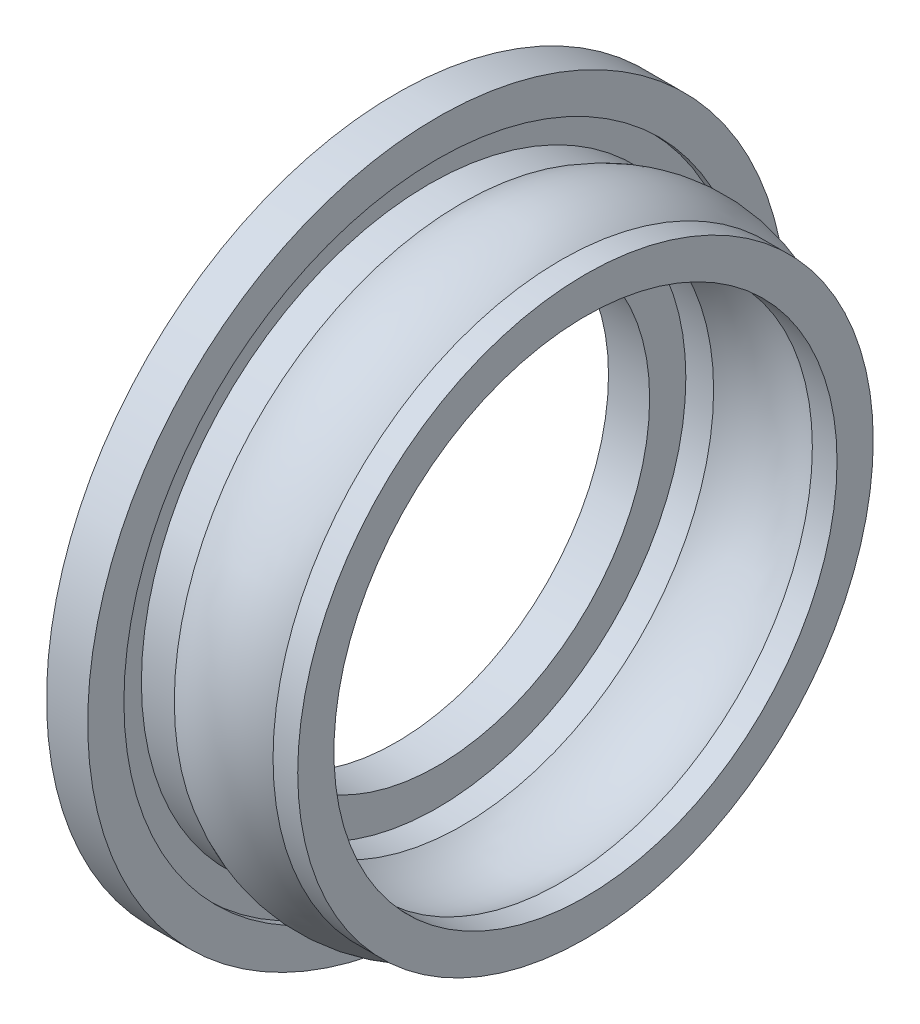
ISO-10303-21;
HEADER;
FILE_DESCRIPTION(('STEP AP214'),'2;1');
FILE_NAME('part.step','',(''),(''),'','','');
FILE_SCHEMA(('AUTOMOTIVE_DESIGN { 1 0 10303 214 1 1 1 1 }'));
ENDSEC;
DATA;
#1=APPLICATION_CONTEXT('core data for automotive mechanical design processes');
#2=APPLICATION_PROTOCOL_DEFINITION('international standard','automotive_design',2000,#1);
#3=PRODUCT_CONTEXT('',#1,'mechanical');
#4=PRODUCT('Part','Part','',(#3));
#5=PRODUCT_RELATED_PRODUCT_CATEGORY('part','',(#4));
#6=PRODUCT_DEFINITION_FORMATION('','',#4);
#7=PRODUCT_DEFINITION_CONTEXT('part definition',#1,'design');
#8=PRODUCT_DEFINITION('design','',#6,#7);
#9=PRODUCT_DEFINITION_SHAPE('','',#8);
#10=(LENGTH_UNIT() NAMED_UNIT(*) SI_UNIT(.MILLI.,.METRE.));
#11=(NAMED_UNIT(*) PLANE_ANGLE_UNIT() SI_UNIT($,.RADIAN.));
#12=(NAMED_UNIT(*) SI_UNIT($,.STERADIAN.) SOLID_ANGLE_UNIT());
#13=UNCERTAINTY_MEASURE_WITH_UNIT(LENGTH_MEASURE(1.E-05),#10,'distance_accuracy_value','');
#14=(GEOMETRIC_REPRESENTATION_CONTEXT(3) GLOBAL_UNCERTAINTY_ASSIGNED_CONTEXT((#13)) GLOBAL_UNIT_ASSIGNED_CONTEXT((#10,
#11,#12)) REPRESENTATION_CONTEXT('',''));
#15=CARTESIAN_POINT('',(0.,0.,0.));
#16=DIRECTION('',(0.,0.,1.));
#17=DIRECTION('',(1.,0.,0.));
#18=AXIS2_PLACEMENT_3D('',#15,#16,#17);
#19=CARTESIAN_POINT('',(2.,0.,0.));
#20=DIRECTION('',(1.,0.,0.));
#21=DIRECTION('',(0.,0.,-1.));
#22=AXIS2_PLACEMENT_3D('',#19,#20,#21);
#23=PLANE('',#22);
#24=CARTESIAN_POINT('',(2.,0.,0.));
#25=DIRECTION('',(1.,0.,0.));
#26=DIRECTION('',(0.,0.,-1.));
#27=AXIS2_PLACEMENT_3D('',#24,#25,#26);
#28=CIRCLE('',#27,10.32);
#29=CARTESIAN_POINT('',(2.,0.,-10.32));
#30=VERTEX_POINT('',#29);
#31=EDGE_CURVE('E47',#30,#30,#28,.T.);
#32=ORIENTED_EDGE('',*,*,#31,.F.);
#33=EDGE_LOOP('',(#32));
#34=FACE_BOUND('',#33,.T.);
#35=CARTESIAN_POINT('',(2.,0.,0.));
#36=DIRECTION('',(1.,0.,0.));
#37=DIRECTION('',(0.,0.,-1.));
#38=AXIS2_PLACEMENT_3D('',#35,#36,#37);
#39=CIRCLE('',#38,12.08);
#40=CARTESIAN_POINT('',(2.,0.,-12.08));
#41=VERTEX_POINT('',#40);
#42=EDGE_CURVE('E87',#41,#41,#39,.T.);
#43=ORIENTED_EDGE('',*,*,#42,.T.);
#44=EDGE_LOOP('',(#43));
#45=FACE_BOUND('',#44,.T.);
#46=ADVANCED_FACE('F36',(#34,#45),#23,.T.);
#47=CARTESIAN_POINT('',(2.,0.,0.));
#48=DIRECTION('',(1.,0.,0.));
#49=DIRECTION('',(0.,0.,-1.));
#50=AXIS2_PLACEMENT_3D('',#47,#48,#49);
#51=CIRCLE('',#50,15.24);
#52=CARTESIAN_POINT('',(2.,0.,-15.24));
#53=VERTEX_POINT('',#52);
#54=EDGE_CURVE('E75',#53,#53,#51,.T.);
#55=ORIENTED_EDGE('',*,*,#54,.F.);
#56=EDGE_LOOP('',(#55));
#57=FACE_BOUND('',#56,.T.);
#58=CARTESIAN_POINT('',(2.,0.,0.));
#59=DIRECTION('',(1.,0.,0.));
#60=DIRECTION('',(0.,0.,-1.));
#61=AXIS2_PLACEMENT_3D('',#58,#59,#60);
#62=CIRCLE('',#61,17.);
#63=CARTESIAN_POINT('',(2.,0.,-17.));
#64=VERTEX_POINT('',#63);
#65=EDGE_CURVE('E10',#64,#64,#62,.T.);
#66=ORIENTED_EDGE('',*,*,#65,.T.);
#67=EDGE_LOOP('',(#66));
#68=FACE_BOUND('',#67,.T.);
#69=ADVANCED_FACE('F120',(#57,#68),#23,.T.);
#70=CARTESIAN_POINT('',(0.,0.,0.));
#71=DIRECTION('',(1.,0.,0.));
#72=DIRECTION('',(0.,0.,-1.));
#73=AXIS2_PLACEMENT_3D('',#70,#71,#72);
#74=PLANE('',#73);
#75=CARTESIAN_POINT('',(0.,0.,0.));
#76=DIRECTION('',(1.,0.,0.));
#77=DIRECTION('',(0.,0.,-1.));
#78=AXIS2_PLACEMENT_3D('',#75,#76,#77);
#79=CIRCLE('',#78,17.);
#80=CARTESIAN_POINT('',(0.,0.,-17.));
#81=VERTEX_POINT('',#80);
#82=EDGE_CURVE('E40',#81,#81,#79,.T.);
#83=ORIENTED_EDGE('',*,*,#82,.F.);
#84=EDGE_LOOP('',(#83));
#85=FACE_BOUND('',#84,.T.);
#86=CARTESIAN_POINT('',(0.,0.,0.));
#87=DIRECTION('',(1.,0.,0.));
#88=DIRECTION('',(0.,0.,-1.));
#89=AXIS2_PLACEMENT_3D('',#86,#87,#88);
#90=CIRCLE('',#89,10.32);
#91=CARTESIAN_POINT('',(0.,0.,-10.32));
#92=VERTEX_POINT('',#91);
#93=EDGE_CURVE('E49',#92,#92,#90,.T.);
#94=ORIENTED_EDGE('',*,*,#93,.T.);
#95=EDGE_LOOP('',(#94));
#96=FACE_BOUND('',#95,.T.);
#97=ADVANCED_FACE('F126',(#85,#96),#74,.F.);
#98=CARTESIAN_POINT('',(2.,0.,0.));
#99=DIRECTION('',(-1.,0.,0.));
#100=DIRECTION('',(0.,0.,1.));
#101=AXIS2_PLACEMENT_3D('',#98,#99,#100);
#102=CYLINDRICAL_SURFACE('',#101,17.);
#103=ORIENTED_EDGE('',*,*,#65,.F.);
#104=EDGE_LOOP('',(#103));
#105=FACE_BOUND('',#104,.T.);
#106=ORIENTED_EDGE('',*,*,#82,.T.);
#107=EDGE_LOOP('',(#106));
#108=FACE_BOUND('',#107,.T.);
#109=ADVANCED_FACE('F38',(#105,#108),#102,.T.);
#110=CARTESIAN_POINT('',(2.,0.,0.));
#111=DIRECTION('',(-1.,0.,0.));
#112=DIRECTION('',(0.,0.,1.));
#113=AXIS2_PLACEMENT_3D('',#110,#111,#112);
#114=CYLINDRICAL_SURFACE('',#113,10.32);
#115=ORIENTED_EDGE('',*,*,#31,.T.);
#116=EDGE_LOOP('',(#115));
#117=FACE_BOUND('',#116,.T.);
#118=ORIENTED_EDGE('',*,*,#93,.F.);
#119=EDGE_LOOP('',(#118));
#120=FACE_BOUND('',#119,.T.);
#121=ADVANCED_FACE('F131',(#117,#120),#114,.F.);
#122=CARTESIAN_POINT('',(2.,0.,0.));
#123=DIRECTION('',(1.,0.,0.));
#124=DIRECTION('',(0.,0.,-1.));
#125=AXIS2_PLACEMENT_3D('',#122,#123,#124);
#126=CYLINDRICAL_SURFACE('',#125,13.99);
#127=CARTESIAN_POINT('',(7.99999676108462,0.,0.));
#128=DIRECTION('',(1.,0.,0.));
#129=DIRECTION('',(0.,0.,-1.));
#130=AXIS2_PLACEMENT_3D('',#127,#128,#129);
#131=CIRCLE('',#130,13.99);
#132=CARTESIAN_POINT('',(7.99999676108462,0.,-13.99));
#133=VERTEX_POINT('',#132);
#134=EDGE_CURVE('E70',#133,#133,#131,.T.);
#135=ORIENTED_EDGE('',*,*,#134,.T.);
#136=EDGE_LOOP('',(#135));
#137=FACE_BOUND('',#136,.T.);
#138=CARTESIAN_POINT('',(9.2,0.,0.));
#139=DIRECTION('',(1.,0.,0.));
#140=DIRECTION('',(0.,0.,-1.));
#141=AXIS2_PLACEMENT_3D('',#138,#139,#140);
#142=CIRCLE('',#141,13.99);
#143=CARTESIAN_POINT('',(9.2,0.,-13.99));
#144=VERTEX_POINT('',#143);
#145=EDGE_CURVE('E52',#144,#144,#142,.T.);
#146=ORIENTED_EDGE('',*,*,#145,.F.);
#147=EDGE_LOOP('',(#146));
#148=FACE_BOUND('',#147,.T.);
#149=ADVANCED_FACE('F144',(#137,#148),#126,.T.);
#150=CARTESIAN_POINT('',(9.2,0.,-13.99));
#151=DIRECTION('',(1.,0.,0.));
#152=DIRECTION('',(0.,0.,-1.));
#153=AXIS2_PLACEMENT_3D('',#150,#151,#152);
#154=PLANE('',#153);
#155=ORIENTED_EDGE('',*,*,#145,.T.);
#156=EDGE_LOOP('',(#155));
#157=FACE_BOUND('',#156,.T.);
#158=CARTESIAN_POINT('',(9.2,0.,0.));
#159=DIRECTION('',(1.,0.,0.));
#160=DIRECTION('',(0.,0.,-1.));
#161=AXIS2_PLACEMENT_3D('',#158,#159,#160);
#162=CIRCLE('',#161,12.23);
#163=CARTESIAN_POINT('',(9.2,0.,-12.23));
#164=VERTEX_POINT('',#163);
#165=EDGE_CURVE('E57',#164,#164,#162,.T.);
#166=ORIENTED_EDGE('',*,*,#165,.F.);
#167=EDGE_LOOP('',(#166));
#168=FACE_BOUND('',#167,.T.);
#169=ADVANCED_FACE('F149',(#157,#168),#154,.T.);
#170=CARTESIAN_POINT('',(2.,0.,0.));
#171=DIRECTION('',(1.,0.,0.));
#172=DIRECTION('',(0.,0.,-1.));
#173=AXIS2_PLACEMENT_3D('',#170,#171,#172);
#174=CYLINDRICAL_SURFACE('',#173,12.23);
#175=ORIENTED_EDGE('',*,*,#165,.T.);
#176=EDGE_LOOP('',(#175));
#177=FACE_BOUND('',#176,.T.);
#178=CARTESIAN_POINT('',(8.,0.,0.));
#179=DIRECTION('',(1.,0.,0.));
#180=DIRECTION('',(0.,0.,-1.));
#181=AXIS2_PLACEMENT_3D('',#178,#179,#180);
#182=CIRCLE('',#181,12.23);
#183=CARTESIAN_POINT('',(8.,0.,-12.23));
#184=VERTEX_POINT('',#183);
#185=EDGE_CURVE('E60',#184,#184,#182,.T.);
#186=ORIENTED_EDGE('',*,*,#185,.F.);
#187=EDGE_LOOP('',(#186));
#188=FACE_BOUND('',#187,.T.);
#189=ADVANCED_FACE('F116',(#177,#188),#174,.F.);
#190=CARTESIAN_POINT('',(5.6,0.,0.));
#191=DIRECTION('',(1.,0.,0.));
#192=DIRECTION('',(0.,0.,-1.));
#193=AXIS2_PLACEMENT_3D('',#190,#191,#192);
#194=TOROIDAL_SURFACE('',#193,8.19636363636361,4.69363636363639);
#195=ORIENTED_EDGE('',*,*,#185,.T.);
#196=EDGE_LOOP('',(#195));
#197=FACE_BOUND('',#196,.T.);
#198=CARTESIAN_POINT('',(3.2,0.,0.));
#199=DIRECTION('',(1.,0.,0.));
#200=DIRECTION('',(0.,0.,-1.));
#201=AXIS2_PLACEMENT_3D('',#198,#199,#200);
#202=CIRCLE('',#201,12.23);
#203=CARTESIAN_POINT('',(3.2,0.,-12.23));
#204=VERTEX_POINT('',#203);
#205=EDGE_CURVE('E64',#204,#204,#202,.T.);
#206=ORIENTED_EDGE('',*,*,#205,.F.);
#207=EDGE_LOOP('',(#206));
#208=FACE_BOUND('',#207,.T.);
#209=ADVANCED_FACE('F106',(#197,#208),#194,.F.);
#210=CARTESIAN_POINT('',(2.,0.,0.));
#211=DIRECTION('',(1.,0.,0.));
#212=DIRECTION('',(0.,0.,-1.));
#213=AXIS2_PLACEMENT_3D('',#210,#211,#212);
#214=CYLINDRICAL_SURFACE('',#213,12.23);
#215=ORIENTED_EDGE('',*,*,#205,.T.);
#216=EDGE_LOOP('',(#215));
#217=FACE_BOUND('',#216,.T.);
#218=CARTESIAN_POINT('',(1.6,0.,0.));
#219=DIRECTION('',(1.,0.,0.));
#220=DIRECTION('',(0.,0.,-1.));
#221=AXIS2_PLACEMENT_3D('',#218,#219,#220);
#222=CIRCLE('',#221,12.23);
#223=CARTESIAN_POINT('',(1.6,0.,-12.23));
#224=VERTEX_POINT('',#223);
#225=EDGE_CURVE('E83',#224,#224,#222,.T.);
#226=ORIENTED_EDGE('',*,*,#225,.F.);
#227=EDGE_LOOP('',(#226));
#228=FACE_BOUND('',#227,.T.);
#229=ADVANCED_FACE('F103',(#217,#228),#214,.F.);
#230=CARTESIAN_POINT('',(2.,0.,0.));
#231=DIRECTION('',(1.,0.,0.));
#232=DIRECTION('',(0.,0.,-1.));
#233=AXIS2_PLACEMENT_3D('',#230,#231,#232);
#234=CYLINDRICAL_SURFACE('',#233,13.99);
#235=CARTESIAN_POINT('',(3.19999994175124,0.,0.));
#236=DIRECTION('',(1.,0.,0.));
#237=DIRECTION('',(0.,0.,-1.));
#238=AXIS2_PLACEMENT_3D('',#235,#236,#237);
#239=CIRCLE('',#238,13.99);
#240=CARTESIAN_POINT('',(3.19999994175124,0.,-13.99));
#241=VERTEX_POINT('',#240);
#242=EDGE_CURVE('E67',#241,#241,#239,.T.);
#243=ORIENTED_EDGE('',*,*,#242,.F.);
#244=EDGE_LOOP('',(#243));
#245=FACE_BOUND('',#244,.T.);
#246=CARTESIAN_POINT('',(1.6,0.,0.));
#247=DIRECTION('',(1.,0.,0.));
#248=DIRECTION('',(0.,0.,-1.));
#249=AXIS2_PLACEMENT_3D('',#246,#247,#248);
#250=CIRCLE('',#249,13.99);
#251=CARTESIAN_POINT('',(1.6,0.,-13.99));
#252=VERTEX_POINT('',#251);
#253=EDGE_CURVE('E78',#252,#252,#250,.T.);
#254=ORIENTED_EDGE('',*,*,#253,.T.);
#255=EDGE_LOOP('',(#254));
#256=FACE_BOUND('',#255,.T.);
#257=ADVANCED_FACE('F105',(#245,#256),#234,.T.);
#258=CARTESIAN_POINT('',(5.59999835141793,0.,0.));
#259=DIRECTION('',(1.,0.,0.));
#260=DIRECTION('',(0.,0.,-1.));
#261=AXIS2_PLACEMENT_3D('',#258,#259,#260);
#262=TOROIDAL_SURFACE('',#261,9.95636941939193,4.69363058060807);
#263=ORIENTED_EDGE('',*,*,#242,.T.);
#264=EDGE_LOOP('',(#263));
#265=FACE_BOUND('',#264,.T.);
#266=ORIENTED_EDGE('',*,*,#134,.F.);
#267=EDGE_LOOP('',(#266));
#268=FACE_BOUND('',#267,.T.);
#269=ADVANCED_FACE('F113',(#265,#268),#262,.T.);
#270=CARTESIAN_POINT('',(1.6,0.,0.));
#271=DIRECTION('',(1.,0.,0.));
#272=DIRECTION('',(0.,0.,-1.));
#273=AXIS2_PLACEMENT_3D('',#270,#271,#272);
#274=CYLINDRICAL_SURFACE('',#273,15.24);
#275=CARTESIAN_POINT('',(1.6,0.,0.));
#276=DIRECTION('',(1.,0.,0.));
#277=DIRECTION('',(0.,0.,-1.));
#278=AXIS2_PLACEMENT_3D('',#275,#276,#277);
#279=CIRCLE('',#278,15.24);
#280=CARTESIAN_POINT('',(1.6,0.,-15.24));
#281=VERTEX_POINT('',#280);
#282=EDGE_CURVE('E74',#281,#281,#279,.T.);
#283=ORIENTED_EDGE('',*,*,#282,.F.);
#284=EDGE_LOOP('',(#283));
#285=FACE_BOUND('',#284,.T.);
#286=ORIENTED_EDGE('',*,*,#54,.T.);
#287=EDGE_LOOP('',(#286));
#288=FACE_BOUND('',#287,.T.);
#289=ADVANCED_FACE('F185',(#285,#288),#274,.F.);
#290=CARTESIAN_POINT('',(1.6,0.,0.));
#291=DIRECTION('',(1.,0.,0.));
#292=DIRECTION('',(0.,0.,-1.));
#293=AXIS2_PLACEMENT_3D('',#290,#291,#292);
#294=PLANE('',#293);
#295=ORIENTED_EDGE('',*,*,#253,.F.);
#296=EDGE_LOOP('',(#295));
#297=FACE_BOUND('',#296,.T.);
#298=ORIENTED_EDGE('',*,*,#282,.T.);
#299=EDGE_LOOP('',(#298));
#300=FACE_BOUND('',#299,.T.);
#301=ADVANCED_FACE('F99',(#297,#300),#294,.T.);
#302=CARTESIAN_POINT('',(1.6,0.,0.));
#303=DIRECTION('',(1.,0.,0.));
#304=DIRECTION('',(0.,0.,-1.));
#305=AXIS2_PLACEMENT_3D('',#302,#303,#304);
#306=PLANE('',#305);
#307=CARTESIAN_POINT('',(1.6,0.,0.));
#308=DIRECTION('',(1.,0.,0.));
#309=DIRECTION('',(0.,0.,-1.));
#310=AXIS2_PLACEMENT_3D('',#307,#308,#309);
#311=CIRCLE('',#310,12.08);
#312=CARTESIAN_POINT('',(1.6,0.,-12.08));
#313=VERTEX_POINT('',#312);
#314=EDGE_CURVE('E86',#313,#313,#311,.T.);
#315=ORIENTED_EDGE('',*,*,#314,.F.);
#316=EDGE_LOOP('',(#315));
#317=FACE_BOUND('',#316,.T.);
#318=ORIENTED_EDGE('',*,*,#225,.T.);
#319=EDGE_LOOP('',(#318));
#320=FACE_BOUND('',#319,.T.);
#321=ADVANCED_FACE('F96',(#317,#320),#306,.T.);
#322=CARTESIAN_POINT('',(1.6,0.,0.));
#323=DIRECTION('',(1.,0.,0.));
#324=DIRECTION('',(0.,0.,-1.));
#325=AXIS2_PLACEMENT_3D('',#322,#323,#324);
#326=CYLINDRICAL_SURFACE('',#325,12.08);
#327=ORIENTED_EDGE('',*,*,#314,.T.);
#328=EDGE_LOOP('',(#327));
#329=FACE_BOUND('',#328,.T.);
#330=ORIENTED_EDGE('',*,*,#42,.F.);
#331=EDGE_LOOP('',(#330));
#332=FACE_BOUND('',#331,.T.);
#333=ADVANCED_FACE('F93',(#329,#332),#326,.T.);
#334=CLOSED_SHELL('',(#46,#69,#97,#109,#121,#149,#169,#189,#209,#229,#257,#269,#289,#301,#321,#333));
#335=MANIFOLD_SOLID_BREP('B2',#334);
#336=ADVANCED_BREP_SHAPE_REPRESENTATION('',(#18,#335),#14);
#337=SHAPE_DEFINITION_REPRESENTATION(#9,#336);
ENDSEC;
END-ISO-10303-21;
